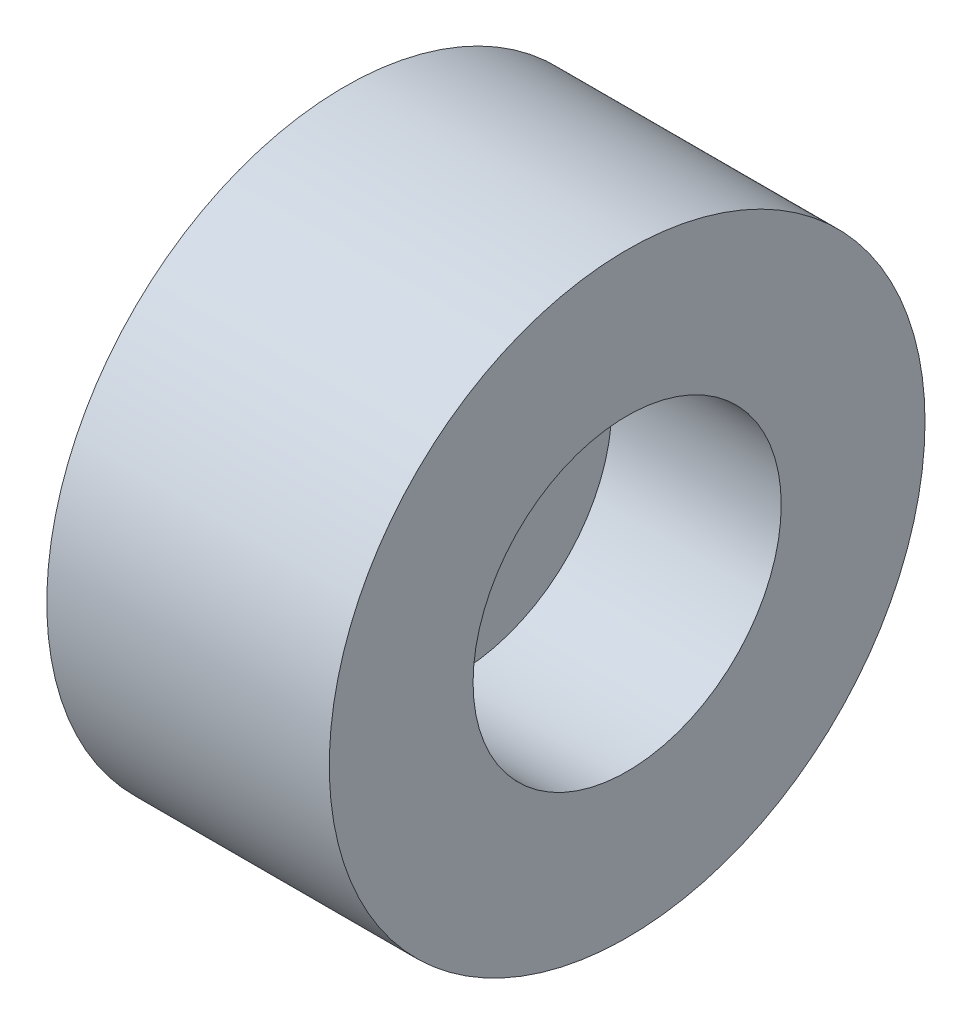
ISO-10303-21;
HEADER;
FILE_DESCRIPTION(('STEP AP214'),'2;1');
FILE_NAME('part.step','',(''),(''),'','','');
FILE_SCHEMA(('AUTOMOTIVE_DESIGN { 1 0 10303 214 1 1 1 1 }'));
ENDSEC;
DATA;
#1=APPLICATION_CONTEXT('core data for automotive mechanical design processes');
#2=APPLICATION_PROTOCOL_DEFINITION('international standard','automotive_design',2000,#1);
#3=PRODUCT_CONTEXT('',#1,'mechanical');
#4=PRODUCT('Part','Part','',(#3));
#5=PRODUCT_RELATED_PRODUCT_CATEGORY('part','',(#4));
#6=PRODUCT_DEFINITION_FORMATION('','',#4);
#7=PRODUCT_DEFINITION_CONTEXT('part definition',#1,'design');
#8=PRODUCT_DEFINITION('design','',#6,#7);
#9=PRODUCT_DEFINITION_SHAPE('','',#8);
#10=(LENGTH_UNIT() NAMED_UNIT(*) SI_UNIT(.MILLI.,.METRE.));
#11=(NAMED_UNIT(*) PLANE_ANGLE_UNIT() SI_UNIT($,.RADIAN.));
#12=(NAMED_UNIT(*) SI_UNIT($,.STERADIAN.) SOLID_ANGLE_UNIT());
#13=UNCERTAINTY_MEASURE_WITH_UNIT(LENGTH_MEASURE(1.E-05),#10,'distance_accuracy_value','');
#14=(GEOMETRIC_REPRESENTATION_CONTEXT(3) GLOBAL_UNCERTAINTY_ASSIGNED_CONTEXT((#13)) GLOBAL_UNIT_ASSIGNED_CONTEXT((#10,
#11,#12)) REPRESENTATION_CONTEXT('',''));
#15=CARTESIAN_POINT('',(0.,0.,0.));
#16=DIRECTION('',(0.,0.,1.));
#17=DIRECTION('',(1.,0.,0.));
#18=AXIS2_PLACEMENT_3D('',#15,#16,#17);
#19=CARTESIAN_POINT('',(5.5,0.,0.));
#20=DIRECTION('',(-1.,0.,0.));
#21=DIRECTION('',(0.,0.,1.));
#22=AXIS2_PLACEMENT_3D('',#19,#20,#21);
#23=CYLINDRICAL_SURFACE('',#22,5.8);
#24=CARTESIAN_POINT('',(5.5,0.,0.));
#25=DIRECTION('',(1.,0.,0.));
#26=DIRECTION('',(0.,0.,-1.));
#27=AXIS2_PLACEMENT_3D('',#24,#25,#26);
#28=CIRCLE('',#27,5.8);
#29=CARTESIAN_POINT('',(5.5,0.,-5.8));
#30=VERTEX_POINT('',#29);
#31=EDGE_CURVE('E10',#30,#30,#28,.T.);
#32=ORIENTED_EDGE('',*,*,#31,.F.);
#33=EDGE_LOOP('',(#32));
#34=FACE_BOUND('',#33,.T.);
#35=CARTESIAN_POINT('',(0.,0.,0.));
#36=DIRECTION('',(1.,0.,0.));
#37=DIRECTION('',(0.,0.,-1.));
#38=AXIS2_PLACEMENT_3D('',#35,#36,#37);
#39=CIRCLE('',#38,5.8);
#40=CARTESIAN_POINT('',(0.,0.,-5.8));
#41=VERTEX_POINT('',#40);
#42=EDGE_CURVE('E45',#41,#41,#39,.T.);
#43=ORIENTED_EDGE('',*,*,#42,.T.);
#44=EDGE_LOOP('',(#43));
#45=FACE_BOUND('',#44,.T.);
#46=ADVANCED_FACE('F37',(#34,#45),#23,.T.);
#47=CARTESIAN_POINT('',(5.5,0.,0.));
#48=DIRECTION('',(1.,0.,0.));
#49=DIRECTION('',(0.,0.,-1.));
#50=AXIS2_PLACEMENT_3D('',#47,#48,#49);
#51=PLANE('',#50);
#52=CARTESIAN_POINT('',(5.5,0.,0.));
#53=DIRECTION('',(1.,0.,0.));
#54=DIRECTION('',(0.,0.,-1.));
#55=AXIS2_PLACEMENT_3D('',#52,#53,#54);
#56=CIRCLE('',#55,3.);
#57=CARTESIAN_POINT('',(5.5,0.,-3.));
#58=VERTEX_POINT('',#57);
#59=EDGE_CURVE('E53',#58,#58,#56,.T.);
#60=ORIENTED_EDGE('',*,*,#59,.F.);
#61=EDGE_LOOP('',(#60));
#62=FACE_BOUND('',#61,.T.);
#63=ORIENTED_EDGE('',*,*,#31,.T.);
#64=EDGE_LOOP('',(#63));
#65=FACE_BOUND('',#64,.T.);
#66=ADVANCED_FACE('F83',(#62,#65),#51,.T.);
#67=CARTESIAN_POINT('',(0.,0.,0.));
#68=DIRECTION('',(1.,0.,0.));
#69=DIRECTION('',(0.,0.,-1.));
#70=AXIS2_PLACEMENT_3D('',#67,#68,#69);
#71=PLANE('',#70);
#72=CARTESIAN_POINT('',(0.,0.,0.));
#73=DIRECTION('',(1.,0.,0.));
#74=DIRECTION('',(0.,0.,-1.));
#75=AXIS2_PLACEMENT_3D('',#72,#73,#74);
#76=CIRCLE('',#75,1.5);
#77=CARTESIAN_POINT('',(0.,0.,-1.5));
#78=VERTEX_POINT('',#77);
#79=EDGE_CURVE('E40',#78,#78,#76,.T.);
#80=ORIENTED_EDGE('',*,*,#79,.T.);
#81=EDGE_LOOP('',(#80));
#82=FACE_BOUND('',#81,.T.);
#83=ORIENTED_EDGE('',*,*,#42,.F.);
#84=EDGE_LOOP('',(#83));
#85=FACE_BOUND('',#84,.T.);
#86=ADVANCED_FACE('F69',(#82,#85),#71,.F.);
#87=CARTESIAN_POINT('',(2.2,0.,0.));
#88=DIRECTION('',(1.,0.,0.));
#89=DIRECTION('',(0.,0.,-1.));
#90=AXIS2_PLACEMENT_3D('',#87,#88,#89);
#91=CYLINDRICAL_SURFACE('',#90,3.);
#92=CARTESIAN_POINT('',(2.2,0.,0.));
#93=DIRECTION('',(1.,0.,0.));
#94=DIRECTION('',(0.,0.,-1.));
#95=AXIS2_PLACEMENT_3D('',#92,#93,#94);
#96=CIRCLE('',#95,3.);
#97=CARTESIAN_POINT('',(2.2,0.,-3.));
#98=VERTEX_POINT('',#97);
#99=EDGE_CURVE('E51',#98,#98,#96,.T.);
#100=ORIENTED_EDGE('',*,*,#99,.F.);
#101=EDGE_LOOP('',(#100));
#102=FACE_BOUND('',#101,.T.);
#103=ORIENTED_EDGE('',*,*,#59,.T.);
#104=EDGE_LOOP('',(#103));
#105=FACE_BOUND('',#104,.T.);
#106=ADVANCED_FACE('F79',(#102,#105),#91,.F.);
#107=CARTESIAN_POINT('',(2.2,0.,0.));
#108=DIRECTION('',(1.,0.,0.));
#109=DIRECTION('',(0.,0.,-1.));
#110=AXIS2_PLACEMENT_3D('',#107,#108,#109);
#111=PLANE('',#110);
#112=CARTESIAN_POINT('',(2.2,0.,0.));
#113=DIRECTION('',(1.,0.,0.));
#114=DIRECTION('',(0.,0.,-1.));
#115=AXIS2_PLACEMENT_3D('',#112,#113,#114);
#116=CIRCLE('',#115,1.5);
#117=CARTESIAN_POINT('',(2.2,0.,-1.5));
#118=VERTEX_POINT('',#117);
#119=EDGE_CURVE('E60',#118,#118,#116,.T.);
#120=ORIENTED_EDGE('',*,*,#119,.F.);
#121=EDGE_LOOP('',(#120));
#122=FACE_BOUND('',#121,.T.);
#123=ORIENTED_EDGE('',*,*,#99,.T.);
#124=EDGE_LOOP('',(#123));
#125=FACE_BOUND('',#124,.T.);
#126=ADVANCED_FACE('F74',(#122,#125),#111,.T.);
#127=CARTESIAN_POINT('',(-1.1,0.,0.));
#128=DIRECTION('',(1.,0.,0.));
#129=DIRECTION('',(0.,0.,-1.));
#130=AXIS2_PLACEMENT_3D('',#127,#128,#129);
#131=CYLINDRICAL_SURFACE('',#130,1.5);
#132=ORIENTED_EDGE('',*,*,#119,.T.);
#133=EDGE_LOOP('',(#132));
#134=FACE_BOUND('',#133,.T.);
#135=ORIENTED_EDGE('',*,*,#79,.F.);
#136=EDGE_LOOP('',(#135));
#137=FACE_BOUND('',#136,.T.);
#138=ADVANCED_FACE('F72',(#134,#137),#131,.F.);
#139=CLOSED_SHELL('',(#46,#66,#86,#106,#126,#138));
#140=MANIFOLD_SOLID_BREP('B2',#139);
#141=ADVANCED_BREP_SHAPE_REPRESENTATION('',(#18,#140),#14);
#142=SHAPE_DEFINITION_REPRESENTATION(#9,#141);
ENDSEC;
END-ISO-10303-21;
